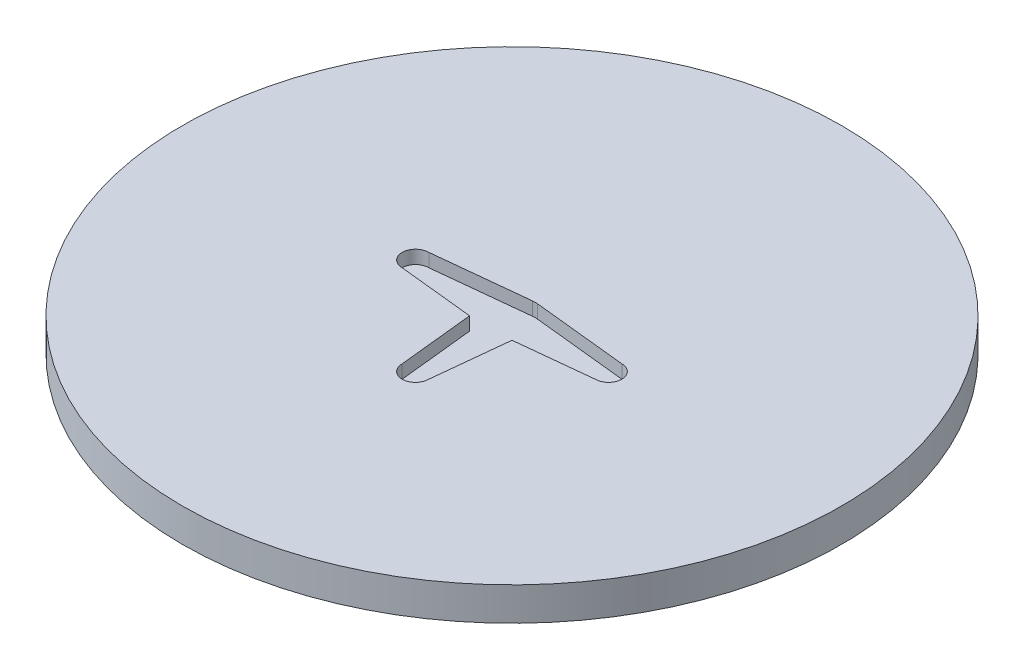
ISO-10303-21;
HEADER;
FILE_DESCRIPTION(('STEP AP214'),'2;1');
FILE_NAME('part.step','',(''),(''),'','','');
FILE_SCHEMA(('AUTOMOTIVE_DESIGN { 1 0 10303 214 1 1 1 1 }'));
ENDSEC;
DATA;
#1=APPLICATION_CONTEXT('core data for automotive mechanical design processes');
#2=APPLICATION_PROTOCOL_DEFINITION('international standard','automotive_design',2000,#1);
#3=PRODUCT_CONTEXT('',#1,'mechanical');
#4=PRODUCT('Part','Part','',(#3));
#5=PRODUCT_RELATED_PRODUCT_CATEGORY('part','',(#4));
#6=PRODUCT_DEFINITION_FORMATION('','',#4);
#7=PRODUCT_DEFINITION_CONTEXT('part definition',#1,'design');
#8=PRODUCT_DEFINITION('design','',#6,#7);
#9=PRODUCT_DEFINITION_SHAPE('','',#8);
#10=(LENGTH_UNIT() NAMED_UNIT(*) SI_UNIT(.MILLI.,.METRE.));
#11=(NAMED_UNIT(*) PLANE_ANGLE_UNIT() SI_UNIT($,.RADIAN.));
#12=(NAMED_UNIT(*) SI_UNIT($,.STERADIAN.) SOLID_ANGLE_UNIT());
#13=UNCERTAINTY_MEASURE_WITH_UNIT(LENGTH_MEASURE(1.E-05),#10,'distance_accuracy_value','');
#14=(GEOMETRIC_REPRESENTATION_CONTEXT(3) GLOBAL_UNCERTAINTY_ASSIGNED_CONTEXT((#13)) GLOBAL_UNIT_ASSIGNED_CONTEXT((#10,
#11,#12)) REPRESENTATION_CONTEXT('',''));
#15=CARTESIAN_POINT('',(0.,0.,0.));
#16=DIRECTION('',(0.,0.,1.));
#17=DIRECTION('',(1.,0.,0.));
#18=AXIS2_PLACEMENT_3D('',#15,#16,#17);
#19=CARTESIAN_POINT('',(0.,5.,0.));
#20=DIRECTION('',(0.,-1.,0.));
#21=DIRECTION('',(0.,0.,-1.));
#22=AXIS2_PLACEMENT_3D('',#19,#20,#21);
#23=CYLINDRICAL_SURFACE('',#22,49.5);
#24=CARTESIAN_POINT('',(0.,5.,0.));
#25=DIRECTION('',(0.,1.,0.));
#26=DIRECTION('',(0.,0.,1.));
#27=AXIS2_PLACEMENT_3D('',#24,#25,#26);
#28=CIRCLE('',#27,49.5);
#29=CARTESIAN_POINT('',(0.,5.,49.5));
#30=VERTEX_POINT('',#29);
#31=EDGE_CURVE('E11',#30,#30,#28,.T.);
#32=ORIENTED_EDGE('',*,*,#31,.F.);
#33=EDGE_LOOP('',(#32));
#34=FACE_BOUND('',#33,.T.);
#35=CARTESIAN_POINT('',(0.,0.,0.));
#36=DIRECTION('',(0.,1.,0.));
#37=DIRECTION('',(0.,0.,1.));
#38=AXIS2_PLACEMENT_3D('',#35,#36,#37);
#39=CIRCLE('',#38,49.5);
#40=CARTESIAN_POINT('',(0.,0.,49.5));
#41=VERTEX_POINT('',#40);
#42=EDGE_CURVE('E42',#41,#41,#39,.T.);
#43=ORIENTED_EDGE('',*,*,#42,.T.);
#44=EDGE_LOOP('',(#43));
#45=FACE_BOUND('',#44,.T.);
#46=ADVANCED_FACE('F39',(#34,#45),#23,.T.);
#47=CARTESIAN_POINT('',(0.,5.,0.));
#48=DIRECTION('',(0.,1.,0.));
#49=DIRECTION('',(0.,0.,1.));
#50=AXIS2_PLACEMENT_3D('',#47,#48,#49);
#51=PLANE('',#50);
#52=DIRECTION('',(0.104199109418575,0.,-0.994556456716448));
#53=VECTOR('',#52,1.);
#54=CARTESIAN_POINT('',(1.99999999999508,5.,14.4999999999985));
#55=LINE('',#54,#53);
#56=CARTESIAN_POINT('',(1.99999999999508,5.,14.4999999999985));
#57=VERTEX_POINT('',#56);
#58=CARTESIAN_POINT('',(3.18542186075908,5.,3.18542186075878));
#59=VERTEX_POINT('',#58);
#60=EDGE_CURVE('E61',#57,#59,#55,.T.);
#61=ORIENTED_EDGE('',*,*,#60,.F.);
#62=CARTESIAN_POINT('',(-4.92003613847647E-12,5.,14.4999999999982));
#63=DIRECTION('',(0.,1.,0.));
#64=DIRECTION('',(0.,0.,1.));
#65=AXIS2_PLACEMENT_3D('',#62,#63,#64);
#66=CIRCLE('',#65,2.);
#67=CARTESIAN_POINT('',(-2.00000000000492,5.,14.4999999998284));
#68=VERTEX_POINT('',#67);
#69=EDGE_CURVE('E241',#68,#57,#66,.T.);
#70=ORIENTED_EDGE('',*,*,#69,.F.);
#71=DIRECTION('',(0.104199109419498,0.,0.994556456716351));
#72=VECTOR('',#71,1.);
#73=CARTESIAN_POINT('',(-2.00000000000492,5.,14.4999999998284));
#74=LINE('',#73,#72);
#75=CARTESIAN_POINT('',(-3.18542186076191,5.,3.1854218607568));
#76=VERTEX_POINT('',#75);
#77=EDGE_CURVE('E293',#76,#68,#74,.T.);
#78=ORIENTED_EDGE('',*,*,#77,.F.);
#79=DIRECTION('',(0.994556456716432,0.,0.104199109418732));
#80=VECTOR('',#79,1.);
#81=CARTESIAN_POINT('',(-14.5000000000015,5.,1.99999999999101));
#82=LINE('',#81,#80);
#83=CARTESIAN_POINT('',(-14.5000000000009,5.,1.99999999999101));
#84=VERTEX_POINT('',#83);
#85=EDGE_CURVE('E291',#84,#76,#82,.T.);
#86=ORIENTED_EDGE('',*,*,#85,.F.);
#87=CARTESIAN_POINT('',(-14.5000000000009,5.,-8.98730331611076E-12));
#88=DIRECTION('',(0.,1.,0.));
#89=DIRECTION('',(0.,0.,1.));
#90=AXIS2_PLACEMENT_3D('',#87,#88,#89);
#91=CIRCLE('',#90,2.);
#92=CARTESIAN_POINT('',(-14.4999999998307,5.,-2.00000000000899));
#93=VERTEX_POINT('',#92);
#94=EDGE_CURVE('E288',#93,#84,#91,.T.);
#95=ORIENTED_EDGE('',*,*,#94,.F.);
#96=DIRECTION('',(-0.9945564567164,0.,0.104199109419028));
#97=VECTOR('',#96,1.);
#98=CARTESIAN_POINT('',(-14.4999999998307,5.,-2.00000000000899));
#99=LINE('',#98,#97);
#100=CARTESIAN_POINT('',(-0.364696882965874,5.,-3.48094759850748));
#101=VERTEX_POINT('',#100);
#102=EDGE_CURVE('E285',#101,#93,#99,.T.);
#103=ORIENTED_EDGE('',*,*,#102,.F.);
#104=CARTESIAN_POINT('',(0.,5.,0.));
#105=DIRECTION('',(0.,1.,0.));
#106=DIRECTION('',(0.,0.,1.));
#107=AXIS2_PLACEMENT_3D('',#104,#105,#106);
#108=CIRCLE('',#107,3.5);
#109=CARTESIAN_POINT('',(0.364696882964465,5.,-3.48094759850762));
#110=VERTEX_POINT('',#109);
#111=EDGE_CURVE('E282',#110,#101,#108,.T.);
#112=ORIENTED_EDGE('',*,*,#111,.F.);
#113=DIRECTION('',(-0.994556456716464,0.,-0.104199109418419));
#114=VECTOR('',#113,1.);
#115=CARTESIAN_POINT('',(14.5,5.,-2.));
#116=LINE('',#115,#114);
#117=CARTESIAN_POINT('',(14.5,5.,-2.));
#118=VERTEX_POINT('',#117);
#119=EDGE_CURVE('E279',#118,#110,#116,.T.);
#120=ORIENTED_EDGE('',*,*,#119,.F.);
#121=CARTESIAN_POINT('',(14.5,5.,0.));
#122=DIRECTION('',(0.,1.,0.));
#123=DIRECTION('',(0.,0.,1.));
#124=AXIS2_PLACEMENT_3D('',#121,#122,#123);
#125=CIRCLE('',#124,2.);
#126=CARTESIAN_POINT('',(14.4999999998305,5.,2.));
#127=VERTEX_POINT('',#126);
#128=EDGE_CURVE('E276',#127,#118,#125,.T.);
#129=ORIENTED_EDGE('',*,*,#128,.F.);
#130=DIRECTION('',(0.994556456716335,0.,-0.104199109419655));
#131=VECTOR('',#130,1.);
#132=CARTESIAN_POINT('',(14.4999999998305,5.,2.));
#133=LINE('',#132,#131);
#134=EDGE_CURVE('E273',#59,#127,#133,.T.);
#135=ORIENTED_EDGE('',*,*,#134,.F.);
#136=EDGE_LOOP('',(#61,#70,#78,#86,#95,#103,#112,#120,#129,#135));
#137=FACE_BOUND('',#136,.T.);
#138=ORIENTED_EDGE('',*,*,#31,.T.);
#139=EDGE_LOOP('',(#138));
#140=FACE_BOUND('',#139,.T.);
#141=ADVANCED_FACE('F217',(#137,#140),#51,.T.);
#142=CARTESIAN_POINT('',(0.,0.,0.));
#143=DIRECTION('',(0.,1.,0.));
#144=DIRECTION('',(0.,0.,1.));
#145=AXIS2_PLACEMENT_3D('',#142,#143,#144);
#146=PLANE('',#145);
#147=CARTESIAN_POINT('',(0.,0.,0.));
#148=DIRECTION('',(0.,-1.,0.));
#149=DIRECTION('',(-1.,0.,0.));
#150=AXIS2_PLACEMENT_3D('',#147,#148,#149);
#151=ELLIPSE('',#150,25.,7.5);
#152=CARTESIAN_POINT('',(7.18369713915863,0.,-7.18369713915866));
#153=VERTEX_POINT('',#152);
#154=CARTESIAN_POINT('',(7.18369713915864,0.,7.18369713915861));
#155=VERTEX_POINT('',#154);
#156=EDGE_CURVE('E339',#153,#155,#151,.T.);
#157=ORIENTED_EDGE('',*,*,#156,.F.);
#158=CARTESIAN_POINT('',(0.,0.,0.));
#159=DIRECTION('',(0.,-1.,0.));
#160=DIRECTION('',(0.,0.,-1.));
#161=AXIS2_PLACEMENT_3D('',#158,#159,#160);
#162=ELLIPSE('',#161,25.,7.5);
#163=CARTESIAN_POINT('',(-7.18369713915863,0.,-7.18369713915861));
#164=VERTEX_POINT('',#163);
#165=EDGE_CURVE('E53',#164,#153,#162,.T.);
#166=ORIENTED_EDGE('',*,*,#165,.F.);
#167=CARTESIAN_POINT('',(0.,0.,0.));
#168=DIRECTION('',(0.,-1.,0.));
#169=DIRECTION('',(-1.,0.,0.));
#170=AXIS2_PLACEMENT_3D('',#167,#168,#169);
#171=ELLIPSE('',#170,25.,7.5);
#172=CARTESIAN_POINT('',(-7.18369713915863,0.,7.18369713915865));
#173=VERTEX_POINT('',#172);
#174=EDGE_CURVE('E159',#173,#164,#171,.T.);
#175=ORIENTED_EDGE('',*,*,#174,.F.);
#176=CARTESIAN_POINT('',(0.,0.,0.));
#177=DIRECTION('',(0.,-1.,0.));
#178=DIRECTION('',(0.,0.,-1.));
#179=AXIS2_PLACEMENT_3D('',#176,#177,#178);
#180=ELLIPSE('',#179,25.,7.5);
#181=EDGE_CURVE('E162',#155,#173,#180,.T.);
#182=ORIENTED_EDGE('',*,*,#181,.F.);
#183=EDGE_LOOP('',(#157,#166,#175,#182));
#184=FACE_BOUND('',#183,.T.);
#185=ORIENTED_EDGE('',*,*,#42,.F.);
#186=EDGE_LOOP('',(#185));
#187=FACE_BOUND('',#186,.T.);
#188=ADVANCED_FACE('F216',(#184,#187),#146,.F.);
#189=CARTESIAN_POINT('',(1.99999999999508,3.,14.4999999999985));
#190=DIRECTION('',(0.994556456716448,0.,0.104199109418575));
#191=DIRECTION('',(0.104199109418575,0.,-0.994556456716448));
#192=AXIS2_PLACEMENT_3D('',#189,#190,#191);
#193=PLANE('',#192);
#194=ORIENTED_EDGE('',*,*,#60,.T.);
#195=DIRECTION('',(0.,1.,0.));
#196=VECTOR('',#195,1.);
#197=CARTESIAN_POINT('',(3.18542186075908,3.,3.18542186075878));
#198=LINE('',#197,#196);
#199=CARTESIAN_POINT('',(3.18542186075908,3.,3.18542186075878));
#200=VERTEX_POINT('',#199);
#201=EDGE_CURVE('E257',#200,#59,#198,.T.);
#202=ORIENTED_EDGE('',*,*,#201,.F.);
#203=DIRECTION('',(0.104199109418575,0.,-0.994556456716448));
#204=VECTOR('',#203,1.);
#205=CARTESIAN_POINT('',(1.99999999999508,3.,14.4999999999985));
#206=LINE('',#205,#204);
#207=CARTESIAN_POINT('',(1.99999999999508,3.,14.4999999999985));
#208=VERTEX_POINT('',#207);
#209=EDGE_CURVE('E297',#208,#200,#206,.T.);
#210=ORIENTED_EDGE('',*,*,#209,.F.);
#211=DIRECTION('',(0.,1.,0.));
#212=VECTOR('',#211,1.);
#213=CARTESIAN_POINT('',(1.99999999999508,3.,14.4999999999985));
#214=LINE('',#213,#212);
#215=EDGE_CURVE('E233',#208,#57,#214,.T.);
#216=ORIENTED_EDGE('',*,*,#215,.T.);
#217=EDGE_LOOP('',(#194,#202,#210,#216));
#218=FACE_BOUND('',#217,.T.);
#219=ADVANCED_FACE('F182',(#218),#193,.F.);
#220=CARTESIAN_POINT('',(-4.92003613847647E-12,3.,14.4999999999982));
#221=DIRECTION('',(0.,1.,0.));
#222=DIRECTION('',(0.,0.,1.));
#223=AXIS2_PLACEMENT_3D('',#220,#221,#222);
#224=CYLINDRICAL_SURFACE('',#223,2.);
#225=ORIENTED_EDGE('',*,*,#69,.T.);
#226=ORIENTED_EDGE('',*,*,#215,.F.);
#227=CARTESIAN_POINT('',(-4.92003613847647E-12,3.,14.4999999999982));
#228=DIRECTION('',(0.,1.,0.));
#229=DIRECTION('',(0.,0.,1.));
#230=AXIS2_PLACEMENT_3D('',#227,#228,#229);
#231=CIRCLE('',#230,2.);
#232=CARTESIAN_POINT('',(-2.00000000000492,3.,14.4999999998284));
#233=VERTEX_POINT('',#232);
#234=EDGE_CURVE('E258',#233,#208,#231,.T.);
#235=ORIENTED_EDGE('',*,*,#234,.F.);
#236=DIRECTION('',(0.,1.,0.));
#237=VECTOR('',#236,1.);
#238=CARTESIAN_POINT('',(-2.00000000000492,3.,14.4999999998284));
#239=LINE('',#238,#237);
#240=EDGE_CURVE('E234',#233,#68,#239,.T.);
#241=ORIENTED_EDGE('',*,*,#240,.T.);
#242=EDGE_LOOP('',(#225,#226,#235,#241));
#243=FACE_BOUND('',#242,.T.);
#244=ADVANCED_FACE('F178',(#243),#224,.F.);
#245=CARTESIAN_POINT('',(-2.00000000000492,3.,14.4999999998284));
#246=DIRECTION('',(-0.994556456716351,0.,0.104199109419498));
#247=DIRECTION('',(0.104199109419498,0.,0.994556456716351));
#248=AXIS2_PLACEMENT_3D('',#245,#246,#247);
#249=PLANE('',#248);
#250=ORIENTED_EDGE('',*,*,#77,.T.);
#251=ORIENTED_EDGE('',*,*,#240,.F.);
#252=DIRECTION('',(0.104199109419498,0.,0.994556456716351));
#253=VECTOR('',#252,1.);
#254=CARTESIAN_POINT('',(-2.00000000000492,3.,14.4999999998284));
#255=LINE('',#254,#253);
#256=CARTESIAN_POINT('',(-3.18542186076191,3.,3.1854218607568));
#257=VERTEX_POINT('',#256);
#258=EDGE_CURVE('E263',#257,#233,#255,.T.);
#259=ORIENTED_EDGE('',*,*,#258,.F.);
#260=DIRECTION('',(0.,1.,0.));
#261=VECTOR('',#260,1.);
#262=CARTESIAN_POINT('',(-3.18542186076191,3.,3.1854218607568));
#263=LINE('',#262,#261);
#264=EDGE_CURVE('E238',#257,#76,#263,.T.);
#265=ORIENTED_EDGE('',*,*,#264,.T.);
#266=EDGE_LOOP('',(#250,#251,#259,#265));
#267=FACE_BOUND('',#266,.T.);
#268=ADVANCED_FACE('F181',(#267),#249,.F.);
#269=CARTESIAN_POINT('',(-14.5000000000015,3.,1.99999999999101));
#270=DIRECTION('',(-0.104199109418732,0.,0.994556456716432));
#271=DIRECTION('',(0.994556456716432,0.,0.104199109418732));
#272=AXIS2_PLACEMENT_3D('',#269,#270,#271);
#273=PLANE('',#272);
#274=ORIENTED_EDGE('',*,*,#85,.T.);
#275=ORIENTED_EDGE('',*,*,#264,.F.);
#276=DIRECTION('',(0.994556456716432,0.,0.104199109418732));
#277=VECTOR('',#276,1.);
#278=CARTESIAN_POINT('',(-14.5000000000015,3.,1.99999999999101));
#279=LINE('',#278,#277);
#280=CARTESIAN_POINT('',(-14.5000000000009,3.,1.99999999999101));
#281=VERTEX_POINT('',#280);
#282=EDGE_CURVE('E268',#281,#257,#279,.T.);
#283=ORIENTED_EDGE('',*,*,#282,.F.);
#284=DIRECTION('',(0.,1.,0.));
#285=VECTOR('',#284,1.);
#286=CARTESIAN_POINT('',(-14.5000000000009,3.,1.99999999999101));
#287=LINE('',#286,#285);
#288=EDGE_CURVE('E245',#281,#84,#287,.T.);
#289=ORIENTED_EDGE('',*,*,#288,.T.);
#290=EDGE_LOOP('',(#274,#275,#283,#289));
#291=FACE_BOUND('',#290,.T.);
#292=ADVANCED_FACE('F186',(#291),#273,.F.);
#293=CARTESIAN_POINT('',(-14.5000000000009,3.,-8.98730331611076E-12));
#294=DIRECTION('',(0.,1.,0.));
#295=DIRECTION('',(0.,0.,1.));
#296=AXIS2_PLACEMENT_3D('',#293,#294,#295);
#297=CYLINDRICAL_SURFACE('',#296,2.);
#298=ORIENTED_EDGE('',*,*,#94,.T.);
#299=ORIENTED_EDGE('',*,*,#288,.F.);
#300=CARTESIAN_POINT('',(-14.5000000000009,3.,-8.98730331611076E-12));
#301=DIRECTION('',(0.,1.,0.));
#302=DIRECTION('',(0.,0.,1.));
#303=AXIS2_PLACEMENT_3D('',#300,#301,#302);
#304=CIRCLE('',#303,2.);
#305=CARTESIAN_POINT('',(-14.4999999998307,3.,-2.00000000000899));
#306=VERTEX_POINT('',#305);
#307=EDGE_CURVE('E316',#306,#281,#304,.T.);
#308=ORIENTED_EDGE('',*,*,#307,.F.);
#309=DIRECTION('',(0.,1.,0.));
#310=VECTOR('',#309,1.);
#311=CARTESIAN_POINT('',(-14.4999999998307,3.,-2.00000000000899));
#312=LINE('',#311,#310);
#313=EDGE_CURVE('E247',#306,#93,#312,.T.);
#314=ORIENTED_EDGE('',*,*,#313,.T.);
#315=EDGE_LOOP('',(#298,#299,#308,#314));
#316=FACE_BOUND('',#315,.T.);
#317=ADVANCED_FACE('F190',(#316),#297,.F.);
#318=CARTESIAN_POINT('',(-14.4999999998307,3.,-2.00000000000899));
#319=DIRECTION('',(-0.104199109419028,0.,-0.994556456716401));
#320=DIRECTION('',(-0.994556456716401,0.,0.104199109419028));
#321=AXIS2_PLACEMENT_3D('',#318,#319,#320);
#322=PLANE('',#321);
#323=ORIENTED_EDGE('',*,*,#102,.T.);
#324=ORIENTED_EDGE('',*,*,#313,.F.);
#325=DIRECTION('',(-0.9945564567164,0.,0.104199109419028));
#326=VECTOR('',#325,1.);
#327=CARTESIAN_POINT('',(-14.4999999998307,3.,-2.00000000000899));
#328=LINE('',#327,#326);
#329=CARTESIAN_POINT('',(-0.364696882965874,3.,-3.48094759850748));
#330=VERTEX_POINT('',#329);
#331=EDGE_CURVE('E313',#330,#306,#328,.T.);
#332=ORIENTED_EDGE('',*,*,#331,.F.);
#333=DIRECTION('',(0.,1.,0.));
#334=VECTOR('',#333,1.);
#335=CARTESIAN_POINT('',(-0.364696882965874,3.,-3.48094759850748));
#336=LINE('',#335,#334);
#337=EDGE_CURVE('E249',#330,#101,#336,.T.);
#338=ORIENTED_EDGE('',*,*,#337,.T.);
#339=EDGE_LOOP('',(#323,#324,#332,#338));
#340=FACE_BOUND('',#339,.T.);
#341=ADVANCED_FACE('F194',(#340),#322,.F.);
#342=CARTESIAN_POINT('',(0.,3.,0.));
#343=DIRECTION('',(0.,1.,0.));
#344=DIRECTION('',(0.,0.,1.));
#345=AXIS2_PLACEMENT_3D('',#342,#343,#344);
#346=CYLINDRICAL_SURFACE('',#345,3.5);
#347=ORIENTED_EDGE('',*,*,#111,.T.);
#348=ORIENTED_EDGE('',*,*,#337,.F.);
#349=CARTESIAN_POINT('',(0.,3.,0.));
#350=DIRECTION('',(0.,1.,0.));
#351=DIRECTION('',(0.,0.,1.));
#352=AXIS2_PLACEMENT_3D('',#349,#350,#351);
#353=CIRCLE('',#352,3.5);
#354=CARTESIAN_POINT('',(0.364696882964465,3.,-3.48094759850762));
#355=VERTEX_POINT('',#354);
#356=EDGE_CURVE('E310',#355,#330,#353,.T.);
#357=ORIENTED_EDGE('',*,*,#356,.F.);
#358=DIRECTION('',(0.,1.,0.));
#359=VECTOR('',#358,1.);
#360=CARTESIAN_POINT('',(0.364696882964465,3.,-3.48094759850762));
#361=LINE('',#360,#359);
#362=EDGE_CURVE('E251',#355,#110,#361,.T.);
#363=ORIENTED_EDGE('',*,*,#362,.T.);
#364=EDGE_LOOP('',(#347,#348,#357,#363));
#365=FACE_BOUND('',#364,.T.);
#366=ADVANCED_FACE('F198',(#365),#346,.F.);
#367=CARTESIAN_POINT('',(14.5,3.,-2.));
#368=DIRECTION('',(0.104199109418419,0.,-0.994556456716465));
#369=DIRECTION('',(-0.994556456716464,0.,-0.104199109418419));
#370=AXIS2_PLACEMENT_3D('',#367,#368,#369);
#371=PLANE('',#370);
#372=ORIENTED_EDGE('',*,*,#119,.T.);
#373=ORIENTED_EDGE('',*,*,#362,.F.);
#374=DIRECTION('',(-0.994556456716464,0.,-0.104199109418419));
#375=VECTOR('',#374,1.);
#376=CARTESIAN_POINT('',(14.5,3.,-2.));
#377=LINE('',#376,#375);
#378=CARTESIAN_POINT('',(14.5,3.,-2.));
#379=VERTEX_POINT('',#378);
#380=EDGE_CURVE('E307',#379,#355,#377,.T.);
#381=ORIENTED_EDGE('',*,*,#380,.F.);
#382=DIRECTION('',(0.,1.,0.));
#383=VECTOR('',#382,1.);
#384=CARTESIAN_POINT('',(14.5,3.,-2.));
#385=LINE('',#384,#383);
#386=EDGE_CURVE('E253',#379,#118,#385,.T.);
#387=ORIENTED_EDGE('',*,*,#386,.T.);
#388=EDGE_LOOP('',(#372,#373,#381,#387));
#389=FACE_BOUND('',#388,.T.);
#390=ADVANCED_FACE('F202',(#389),#371,.F.);
#391=CARTESIAN_POINT('',(14.5,3.,0.));
#392=DIRECTION('',(0.,1.,0.));
#393=DIRECTION('',(0.,0.,1.));
#394=AXIS2_PLACEMENT_3D('',#391,#392,#393);
#395=CYLINDRICAL_SURFACE('',#394,2.);
#396=ORIENTED_EDGE('',*,*,#128,.T.);
#397=ORIENTED_EDGE('',*,*,#386,.F.);
#398=CARTESIAN_POINT('',(14.5,3.,0.));
#399=DIRECTION('',(0.,1.,0.));
#400=DIRECTION('',(0.,0.,1.));
#401=AXIS2_PLACEMENT_3D('',#398,#399,#400);
#402=CIRCLE('',#401,2.);
#403=CARTESIAN_POINT('',(14.4999999998305,3.,2.));
#404=VERTEX_POINT('',#403);
#405=EDGE_CURVE('E301',#404,#379,#402,.T.);
#406=ORIENTED_EDGE('',*,*,#405,.F.);
#407=DIRECTION('',(0.,1.,0.));
#408=VECTOR('',#407,1.);
#409=CARTESIAN_POINT('',(14.4999999998305,3.,2.));
#410=LINE('',#409,#408);
#411=EDGE_CURVE('E255',#404,#127,#410,.T.);
#412=ORIENTED_EDGE('',*,*,#411,.T.);
#413=EDGE_LOOP('',(#396,#397,#406,#412));
#414=FACE_BOUND('',#413,.T.);
#415=ADVANCED_FACE('F206',(#414),#395,.F.);
#416=CARTESIAN_POINT('',(14.4999999998305,3.,2.));
#417=DIRECTION('',(0.104199109419655,0.,0.994556456716335));
#418=DIRECTION('',(0.994556456716335,0.,-0.104199109419655));
#419=AXIS2_PLACEMENT_3D('',#416,#417,#418);
#420=PLANE('',#419);
#421=ORIENTED_EDGE('',*,*,#134,.T.);
#422=ORIENTED_EDGE('',*,*,#411,.F.);
#423=DIRECTION('',(0.994556456716335,0.,-0.104199109419655));
#424=VECTOR('',#423,1.);
#425=CARTESIAN_POINT('',(14.4999999998305,3.,2.));
#426=LINE('',#425,#424);
#427=EDGE_CURVE('E298',#200,#404,#426,.T.);
#428=ORIENTED_EDGE('',*,*,#427,.F.);
#429=ORIENTED_EDGE('',*,*,#201,.T.);
#430=EDGE_LOOP('',(#421,#422,#428,#429));
#431=FACE_BOUND('',#430,.T.);
#432=ADVANCED_FACE('F176',(#431),#420,.F.);
#433=CARTESIAN_POINT('',(14.5,3.,0.));
#434=DIRECTION('',(0.,1.,0.));
#435=DIRECTION('',(0.,0.,1.));
#436=AXIS2_PLACEMENT_3D('',#433,#434,#435);
#437=PLANE('',#436);
#438=ORIENTED_EDGE('',*,*,#209,.T.);
#439=ORIENTED_EDGE('',*,*,#427,.T.);
#440=ORIENTED_EDGE('',*,*,#405,.T.);
#441=ORIENTED_EDGE('',*,*,#380,.T.);
#442=ORIENTED_EDGE('',*,*,#356,.T.);
#443=ORIENTED_EDGE('',*,*,#331,.T.);
#444=ORIENTED_EDGE('',*,*,#307,.T.);
#445=ORIENTED_EDGE('',*,*,#282,.T.);
#446=ORIENTED_EDGE('',*,*,#258,.T.);
#447=ORIENTED_EDGE('',*,*,#234,.T.);
#448=EDGE_LOOP('',(#438,#439,#440,#441,#442,#443,#444,#445,#446,#447));
#449=FACE_BOUND('',#448,.T.);
#450=ADVANCED_FACE('F172',(#449),#437,.T.);
#451=CARTESIAN_POINT('',(0.,2.,0.));
#452=DIRECTION('',(0.,-1.,0.));
#453=DIRECTION('',(0.,0.,-1.));
#454=AXIS2_PLACEMENT_3D('',#451,#452,#453);
#455=ELLIPSE('',#454,25.,7.5);
#456=DIRECTION('',(0.,-1.,0.));
#457=VECTOR('',#456,1.);
#458=SURFACE_OF_LINEAR_EXTRUSION('',#455,#457);
#459=ORIENTED_EDGE('',*,*,#165,.T.);
#460=DIRECTION('',(0.,-1.,0.));
#461=VECTOR('',#460,1.);
#462=CARTESIAN_POINT('',(7.18369713915863,2.,-7.18369713915866));
#463=LINE('',#462,#461);
#464=CARTESIAN_POINT('',(7.18369713915863,2.,-7.18369713915866));
#465=VERTEX_POINT('',#464);
#466=EDGE_CURVE('E137',#465,#153,#463,.T.);
#467=ORIENTED_EDGE('',*,*,#466,.F.);
#468=CARTESIAN_POINT('',(-7.18369713915863,2.,-7.18369713915861));
#469=VERTEX_POINT('',#468);
#470=EDGE_CURVE('E141',#469,#465,#455,.T.);
#471=ORIENTED_EDGE('',*,*,#470,.F.);
#472=DIRECTION('',(0.,-1.,0.));
#473=VECTOR('',#472,1.);
#474=CARTESIAN_POINT('',(-7.18369713915863,2.,-7.18369713915861));
#475=LINE('',#474,#473);
#476=EDGE_CURVE('E274',#469,#164,#475,.T.);
#477=ORIENTED_EDGE('',*,*,#476,.T.);
#478=EDGE_LOOP('',(#459,#467,#471,#477));
#479=FACE_BOUND('',#478,.T.);
#480=ADVANCED_FACE('F139',(#479),#458,.F.);
#481=CARTESIAN_POINT('',(0.,2.,0.));
#482=DIRECTION('',(0.,-1.,0.));
#483=DIRECTION('',(-1.,0.,0.));
#484=AXIS2_PLACEMENT_3D('',#481,#482,#483);
#485=ELLIPSE('',#484,25.,7.5);
#486=DIRECTION('',(0.,-1.,0.));
#487=VECTOR('',#486,1.);
#488=SURFACE_OF_LINEAR_EXTRUSION('',#485,#487);
#489=ORIENTED_EDGE('',*,*,#174,.T.);
#490=ORIENTED_EDGE('',*,*,#476,.F.);
#491=CARTESIAN_POINT('',(-7.18369713915863,2.,7.18369713915865));
#492=VERTEX_POINT('',#491);
#493=EDGE_CURVE('E147',#492,#469,#485,.T.);
#494=ORIENTED_EDGE('',*,*,#493,.F.);
#495=DIRECTION('',(0.,-1.,0.));
#496=VECTOR('',#495,1.);
#497=CARTESIAN_POINT('',(-7.18369713915863,2.,7.18369713915865));
#498=LINE('',#497,#496);
#499=EDGE_CURVE('E334',#492,#173,#498,.T.);
#500=ORIENTED_EDGE('',*,*,#499,.T.);
#501=EDGE_LOOP('',(#489,#490,#494,#500));
#502=FACE_BOUND('',#501,.T.);
#503=ADVANCED_FACE('F171',(#502),#488,.F.);
#504=CARTESIAN_POINT('',(0.,2.,0.));
#505=DIRECTION('',(0.,-1.,0.));
#506=DIRECTION('',(0.,0.,-1.));
#507=AXIS2_PLACEMENT_3D('',#504,#505,#506);
#508=ELLIPSE('',#507,25.,7.5);
#509=DIRECTION('',(0.,-1.,0.));
#510=VECTOR('',#509,1.);
#511=SURFACE_OF_LINEAR_EXTRUSION('',#508,#510);
#512=ORIENTED_EDGE('',*,*,#181,.T.);
#513=ORIENTED_EDGE('',*,*,#499,.F.);
#514=CARTESIAN_POINT('',(7.18369713915864,2.,7.18369713915861));
#515=VERTEX_POINT('',#514);
#516=EDGE_CURVE('E155',#515,#492,#508,.T.);
#517=ORIENTED_EDGE('',*,*,#516,.F.);
#518=DIRECTION('',(0.,-1.,0.));
#519=VECTOR('',#518,1.);
#520=CARTESIAN_POINT('',(7.18369713915864,2.,7.18369713915861));
#521=LINE('',#520,#519);
#522=EDGE_CURVE('E146',#515,#155,#521,.T.);
#523=ORIENTED_EDGE('',*,*,#522,.T.);
#524=EDGE_LOOP('',(#512,#513,#517,#523));
#525=FACE_BOUND('',#524,.T.);
#526=ADVANCED_FACE('F347',(#525),#511,.F.);
#527=CARTESIAN_POINT('',(0.,2.,0.));
#528=DIRECTION('',(0.,-1.,0.));
#529=DIRECTION('',(-1.,0.,0.));
#530=AXIS2_PLACEMENT_3D('',#527,#528,#529);
#531=ELLIPSE('',#530,25.,7.5);
#532=DIRECTION('',(0.,-1.,0.));
#533=VECTOR('',#532,1.);
#534=SURFACE_OF_LINEAR_EXTRUSION('',#531,#533);
#535=ORIENTED_EDGE('',*,*,#156,.T.);
#536=ORIENTED_EDGE('',*,*,#522,.F.);
#537=EDGE_CURVE('E150',#465,#515,#531,.T.);
#538=ORIENTED_EDGE('',*,*,#537,.F.);
#539=ORIENTED_EDGE('',*,*,#466,.T.);
#540=EDGE_LOOP('',(#535,#536,#538,#539));
#541=FACE_BOUND('',#540,.T.);
#542=ADVANCED_FACE('F151',(#541),#534,.F.);
#543=CARTESIAN_POINT('',(0.,2.,0.));
#544=DIRECTION('',(0.,-1.,0.));
#545=DIRECTION('',(0.,0.,-1.));
#546=AXIS2_PLACEMENT_3D('',#543,#544,#545);
#547=PLANE('',#546);
#548=ORIENTED_EDGE('',*,*,#470,.T.);
#549=ORIENTED_EDGE('',*,*,#537,.T.);
#550=ORIENTED_EDGE('',*,*,#516,.T.);
#551=ORIENTED_EDGE('',*,*,#493,.T.);
#552=EDGE_LOOP('',(#548,#549,#550,#551));
#553=FACE_BOUND('',#552,.T.);
#554=ADVANCED_FACE('F157',(#553),#547,.T.);
#555=CLOSED_SHELL('',(#46,#141,#188,#219,#244,#268,#292,#317,#341,#366,#390,#415,#432,#450,#480,
#503,#526,#542,#554));
#556=MANIFOLD_SOLID_BREP('B2',#555);
#557=ADVANCED_BREP_SHAPE_REPRESENTATION('',(#18,#556),#14);
#558=SHAPE_DEFINITION_REPRESENTATION(#9,#557);
ENDSEC;
END-ISO-10303-21;
